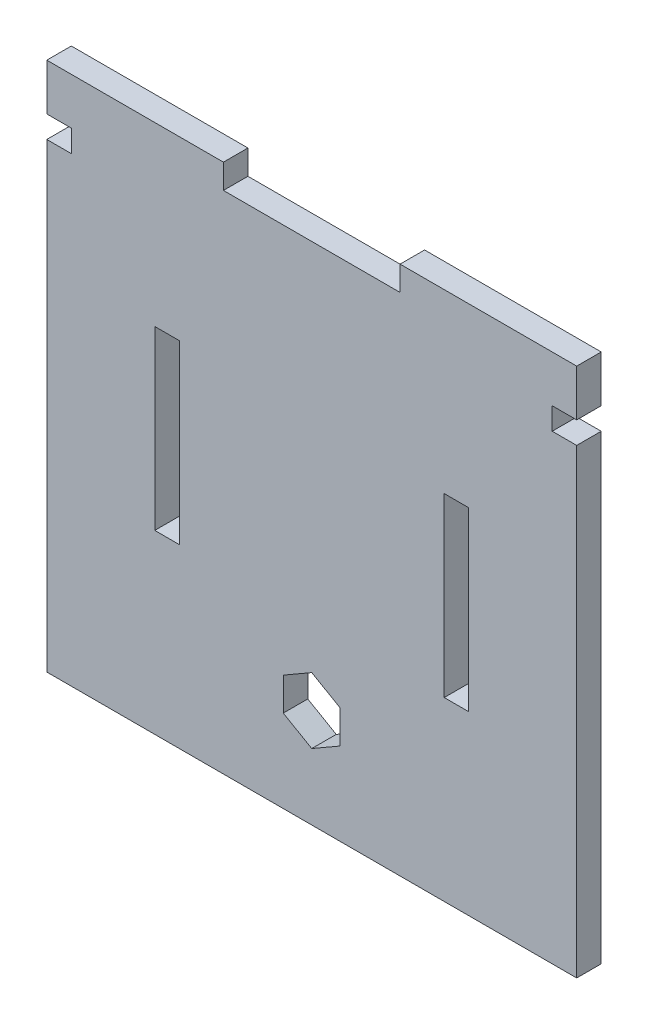
ISO-10303-21;
HEADER;
FILE_DESCRIPTION(('STEP AP214'),'2;1');
FILE_NAME('part.step','',(''),(''),'','','');
FILE_SCHEMA(('AUTOMOTIVE_DESIGN { 1 0 10303 214 1 1 1 1 }'));
ENDSEC;
DATA;
#1=APPLICATION_CONTEXT('core data for automotive mechanical design processes');
#2=APPLICATION_PROTOCOL_DEFINITION('international standard','automotive_design',2000,#1);
#3=PRODUCT_CONTEXT('',#1,'mechanical');
#4=PRODUCT('Part','Part','',(#3));
#5=PRODUCT_RELATED_PRODUCT_CATEGORY('part','',(#4));
#6=PRODUCT_DEFINITION_FORMATION('','',#4);
#7=PRODUCT_DEFINITION_CONTEXT('part definition',#1,'design');
#8=PRODUCT_DEFINITION('design','',#6,#7);
#9=PRODUCT_DEFINITION_SHAPE('','',#8);
#10=(LENGTH_UNIT() NAMED_UNIT(*) SI_UNIT(.MILLI.,.METRE.));
#11=(NAMED_UNIT(*) PLANE_ANGLE_UNIT() SI_UNIT($,.RADIAN.));
#12=(NAMED_UNIT(*) SI_UNIT($,.STERADIAN.) SOLID_ANGLE_UNIT());
#13=UNCERTAINTY_MEASURE_WITH_UNIT(LENGTH_MEASURE(1.E-05),#10,'distance_accuracy_value','');
#14=(GEOMETRIC_REPRESENTATION_CONTEXT(3) GLOBAL_UNCERTAINTY_ASSIGNED_CONTEXT((#13)) GLOBAL_UNIT_ASSIGNED_CONTEXT((#10,
#11,#12)) REPRESENTATION_CONTEXT('',''));
#15=CARTESIAN_POINT('',(0.,0.,0.));
#16=DIRECTION('',(0.,0.,1.));
#17=DIRECTION('',(1.,0.,0.));
#18=AXIS2_PLACEMENT_3D('',#15,#16,#17);
#19=CARTESIAN_POINT('',(0.,0.,0.));
#20=DIRECTION('',(0.,0.,-1.));
#21=DIRECTION('',(-1.,0.,0.));
#22=AXIS2_PLACEMENT_3D('',#19,#20,#21);
#23=PLANE('',#22);
#24=DIRECTION('',(0.,1.,0.));
#25=VECTOR('',#24,1.);
#26=CARTESIAN_POINT('',(0.,0.,0.));
#27=LINE('',#26,#25);
#28=CARTESIAN_POINT('',(0.,92.6676666666666,0.));
#29=VERTEX_POINT('',#28);
#30=CARTESIAN_POINT('',(0.,101.6,0.));
#31=VERTEX_POINT('',#30);
#32=EDGE_CURVE('E414',#29,#31,#27,.T.);
#33=ORIENTED_EDGE('',*,*,#32,.T.);
#34=DIRECTION('',(1.,0.,0.));
#35=VECTOR('',#34,1.);
#36=CARTESIAN_POINT('',(0.,101.6,0.));
#37=LINE('',#36,#35);
#38=CARTESIAN_POINT('',(33.8666666666667,101.6,0.));
#39=VERTEX_POINT('',#38);
#40=EDGE_CURVE('E431',#31,#39,#37,.T.);
#41=ORIENTED_EDGE('',*,*,#40,.T.);
#42=DIRECTION('',(0.,-1.,0.));
#43=VECTOR('',#42,1.);
#44=CARTESIAN_POINT('',(33.8666666666667,101.6,0.));
#45=LINE('',#44,#43);
#46=CARTESIAN_POINT('',(33.8666666666667,96.901,0.));
#47=VERTEX_POINT('',#46);
#48=EDGE_CURVE('E411',#39,#47,#45,.T.);
#49=ORIENTED_EDGE('',*,*,#48,.T.);
#50=DIRECTION('',(-1.,0.,0.));
#51=VECTOR('',#50,1.);
#52=CARTESIAN_POINT('',(0.,96.901,0.));
#53=LINE('',#52,#51);
#54=CARTESIAN_POINT('',(67.7333333333333,96.901,0.));
#55=VERTEX_POINT('',#54);
#56=EDGE_CURVE('E11',#55,#47,#53,.T.);
#57=ORIENTED_EDGE('',*,*,#56,.F.);
#58=DIRECTION('',(0.,-1.,0.));
#59=VECTOR('',#58,1.);
#60=CARTESIAN_POINT('',(67.7333333333333,101.6,0.));
#61=LINE('',#60,#59);
#62=CARTESIAN_POINT('',(67.7333333333333,101.6,0.));
#63=VERTEX_POINT('',#62);
#64=EDGE_CURVE('E398',#63,#55,#61,.T.);
#65=ORIENTED_EDGE('',*,*,#64,.F.);
#66=CARTESIAN_POINT('',(101.6,101.6,0.));
#67=VERTEX_POINT('',#66);
#68=EDGE_CURVE('E430',#63,#67,#37,.T.);
#69=ORIENTED_EDGE('',*,*,#68,.T.);
#70=DIRECTION('',(0.,1.,0.));
#71=VECTOR('',#70,1.);
#72=CARTESIAN_POINT('',(101.6,0.,0.));
#73=LINE('',#72,#71);
#74=CARTESIAN_POINT('',(101.6,92.6676666666667,0.));
#75=VERTEX_POINT('',#74);
#76=EDGE_CURVE('E434',#75,#67,#73,.T.);
#77=ORIENTED_EDGE('',*,*,#76,.F.);
#78=DIRECTION('',(-1.,0.,0.));
#79=VECTOR('',#78,1.);
#80=CARTESIAN_POINT('',(101.6,92.6676666666667,0.));
#81=LINE('',#80,#79);
#82=CARTESIAN_POINT('',(96.901,92.6676666666667,0.));
#83=VERTEX_POINT('',#82);
#84=EDGE_CURVE('E275',#75,#83,#81,.T.);
#85=ORIENTED_EDGE('',*,*,#84,.T.);
#86=DIRECTION('',(0.,1.,0.));
#87=VECTOR('',#86,1.);
#88=CARTESIAN_POINT('',(96.901,0.,0.));
#89=LINE('',#88,#87);
#90=CARTESIAN_POINT('',(96.901,88.4343333333334,0.));
#91=VERTEX_POINT('',#90);
#92=EDGE_CURVE('E278',#91,#83,#89,.T.);
#93=ORIENTED_EDGE('',*,*,#92,.F.);
#94=DIRECTION('',(-1.,0.,0.));
#95=VECTOR('',#94,1.);
#96=CARTESIAN_POINT('',(101.6,88.4343333333334,0.));
#97=LINE('',#96,#95);
#98=CARTESIAN_POINT('',(101.6,88.4343333333334,0.));
#99=VERTEX_POINT('',#98);
#100=EDGE_CURVE('E265',#99,#91,#97,.T.);
#101=ORIENTED_EDGE('',*,*,#100,.F.);
#102=CARTESIAN_POINT('',(101.6,0.,0.));
#103=VERTEX_POINT('',#102);
#104=EDGE_CURVE('E435',#103,#99,#73,.T.);
#105=ORIENTED_EDGE('',*,*,#104,.F.);
#106=DIRECTION('',(1.,0.,0.));
#107=VECTOR('',#106,1.);
#108=CARTESIAN_POINT('',(0.,0.,0.));
#109=LINE('',#108,#107);
#110=CARTESIAN_POINT('',(0.,0.,0.));
#111=VERTEX_POINT('',#110);
#112=EDGE_CURVE('E437',#111,#103,#109,.T.);
#113=ORIENTED_EDGE('',*,*,#112,.F.);
#114=CARTESIAN_POINT('',(0.,88.4343333333333,0.));
#115=VERTEX_POINT('',#114);
#116=EDGE_CURVE('E48',#111,#115,#27,.T.);
#117=ORIENTED_EDGE('',*,*,#116,.T.);
#118=DIRECTION('',(-1.,0.,0.));
#119=VECTOR('',#118,1.);
#120=CARTESIAN_POINT('',(4.69899999999999,88.4343333333333,0.));
#121=LINE('',#120,#119);
#122=CARTESIAN_POINT('',(4.69899999999999,88.4343333333333,0.));
#123=VERTEX_POINT('',#122);
#124=EDGE_CURVE('E254',#123,#115,#121,.T.);
#125=ORIENTED_EDGE('',*,*,#124,.F.);
#126=DIRECTION('',(0.,1.,0.));
#127=VECTOR('',#126,1.);
#128=CARTESIAN_POINT('',(4.69899999999999,0.,0.));
#129=LINE('',#128,#127);
#130=CARTESIAN_POINT('',(4.69899999999999,92.6676666666666,0.));
#131=VERTEX_POINT('',#130);
#132=EDGE_CURVE('E241',#123,#131,#129,.T.);
#133=ORIENTED_EDGE('',*,*,#132,.T.);
#134=DIRECTION('',(-1.,0.,0.));
#135=VECTOR('',#134,1.);
#136=CARTESIAN_POINT('',(4.69899999999999,92.6676666666666,0.));
#137=LINE('',#136,#135);
#138=EDGE_CURVE('E232',#131,#29,#137,.T.);
#139=ORIENTED_EDGE('',*,*,#138,.T.);
#140=EDGE_LOOP('',(#33,#41,#49,#57,#65,#69,#77,#85,#93,#101,#105,#113,#117,#125,#133,#139));
#141=FACE_BOUND('',#140,.T.);
#142=DIRECTION('',(-1.,0.,0.));
#143=VECTOR('',#142,1.);
#144=CARTESIAN_POINT('',(80.899,33.8666666666666,0.));
#145=LINE('',#144,#143);
#146=CARTESIAN_POINT('',(80.899,33.8666666666666,0.));
#147=VERTEX_POINT('',#146);
#148=CARTESIAN_POINT('',(76.2,33.8666666666666,0.));
#149=VERTEX_POINT('',#148);
#150=EDGE_CURVE('E350',#147,#149,#145,.T.);
#151=ORIENTED_EDGE('',*,*,#150,.F.);
#152=DIRECTION('',(0.,1.,0.));
#153=VECTOR('',#152,1.);
#154=CARTESIAN_POINT('',(80.899,33.8666666666666,0.));
#155=LINE('',#154,#153);
#156=CARTESIAN_POINT('',(80.899,67.7333333333333,0.));
#157=VERTEX_POINT('',#156);
#158=EDGE_CURVE('E332',#147,#157,#155,.T.);
#159=ORIENTED_EDGE('',*,*,#158,.T.);
#160=DIRECTION('',(-1.,0.,0.));
#161=VECTOR('',#160,1.);
#162=CARTESIAN_POINT('',(80.899,67.7333333333333,0.));
#163=LINE('',#162,#161);
#164=CARTESIAN_POINT('',(76.2,67.7333333333333,0.));
#165=VERTEX_POINT('',#164);
#166=EDGE_CURVE('E347',#157,#165,#163,.T.);
#167=ORIENTED_EDGE('',*,*,#166,.T.);
#168=DIRECTION('',(0.,1.,0.));
#169=VECTOR('',#168,1.);
#170=CARTESIAN_POINT('',(76.2,33.8666666666666,0.));
#171=LINE('',#170,#169);
#172=EDGE_CURVE('E342',#149,#165,#171,.T.);
#173=ORIENTED_EDGE('',*,*,#172,.F.);
#174=EDGE_LOOP('',(#151,#159,#167,#173));
#175=FACE_BOUND('',#174,.T.);
#176=DIRECTION('',(-1.,0.,0.));
#177=VECTOR('',#176,1.);
#178=CARTESIAN_POINT('',(25.4,33.8666666666666,0.));
#179=LINE('',#178,#177);
#180=CARTESIAN_POINT('',(25.4,33.8666666666666,0.));
#181=VERTEX_POINT('',#180);
#182=CARTESIAN_POINT('',(20.701,33.8666666666666,0.));
#183=VERTEX_POINT('',#182);
#184=EDGE_CURVE('E381',#181,#183,#179,.T.);
#185=ORIENTED_EDGE('',*,*,#184,.F.);
#186=DIRECTION('',(0.,1.,0.));
#187=VECTOR('',#186,1.);
#188=CARTESIAN_POINT('',(25.4,33.8666666666666,0.));
#189=LINE('',#188,#187);
#190=CARTESIAN_POINT('',(25.4,67.7333333333333,0.));
#191=VERTEX_POINT('',#190);
#192=EDGE_CURVE('E363',#181,#191,#189,.T.);
#193=ORIENTED_EDGE('',*,*,#192,.T.);
#194=DIRECTION('',(-1.,0.,0.));
#195=VECTOR('',#194,1.);
#196=CARTESIAN_POINT('',(25.4,67.7333333333333,0.));
#197=LINE('',#196,#195);
#198=CARTESIAN_POINT('',(20.701,67.7333333333333,0.));
#199=VERTEX_POINT('',#198);
#200=EDGE_CURVE('E378',#191,#199,#197,.T.);
#201=ORIENTED_EDGE('',*,*,#200,.T.);
#202=DIRECTION('',(0.,1.,0.));
#203=VECTOR('',#202,1.);
#204=CARTESIAN_POINT('',(20.701,33.8666666666666,0.));
#205=LINE('',#204,#203);
#206=EDGE_CURVE('E373',#183,#199,#205,.T.);
#207=ORIENTED_EDGE('',*,*,#206,.F.);
#208=EDGE_LOOP('',(#185,#193,#201,#207));
#209=FACE_BOUND('',#208,.T.);
#210=DIRECTION('',(-0.866025403784436,0.500000000000004,0.));
#211=VECTOR('',#210,1.);
#212=CARTESIAN_POINT('',(23.6602613140315,40.9807747162584,0.));
#213=LINE('',#212,#211);
#214=CARTESIAN_POINT('',(56.261,22.1587294601336,0.));
#215=VERTEX_POINT('',#214);
#216=CARTESIAN_POINT('',(50.8,25.3116392801782,0.));
#217=VERTEX_POINT('',#216);
#218=EDGE_CURVE('E323',#215,#217,#213,.T.);
#219=ORIENTED_EDGE('',*,*,#218,.T.);
#220=DIRECTION('',(-0.86602540378444,-0.499999999999998,0.));
#221=VECTOR('',#220,1.);
#222=CARTESIAN_POINT('',(1.73973868596873,-3.01331579599098,0.));
#223=LINE('',#222,#221);
#224=CARTESIAN_POINT('',(45.339,22.1587294601337,0.));
#225=VERTEX_POINT('',#224);
#226=EDGE_CURVE('E326',#217,#225,#223,.T.);
#227=ORIENTED_EDGE('',*,*,#226,.T.);
#228=DIRECTION('',(0.,-1.,0.));
#229=VECTOR('',#228,1.);
#230=CARTESIAN_POINT('',(45.339,0.,0.));
#231=LINE('',#230,#229);
#232=CARTESIAN_POINT('',(45.339,15.8529098200446,0.));
#233=VERTEX_POINT('',#232);
#234=EDGE_CURVE('E311',#225,#233,#231,.T.);
#235=ORIENTED_EDGE('',*,*,#234,.T.);
#236=DIRECTION('',(0.866025403784436,-0.500000000000004,0.));
#237=VECTOR('',#236,1.);
#238=CARTESIAN_POINT('',(18.1992613140314,31.5220452561248,0.));
#239=LINE('',#238,#237);
#240=CARTESIAN_POINT('',(50.8,12.7,0.));
#241=VERTEX_POINT('',#240);
#242=EDGE_CURVE('E314',#233,#241,#239,.T.);
#243=ORIENTED_EDGE('',*,*,#242,.T.);
#244=DIRECTION('',(0.86602540378444,0.499999999999998,0.));
#245=VECTOR('',#244,1.);
#246=CARTESIAN_POINT('',(7.20073868596872,-12.4720452561246,0.));
#247=LINE('',#246,#245);
#248=CARTESIAN_POINT('',(56.261,15.8529098200445,0.));
#249=VERTEX_POINT('',#248);
#250=EDGE_CURVE('E317',#241,#249,#247,.T.);
#251=ORIENTED_EDGE('',*,*,#250,.T.);
#252=DIRECTION('',(0.,1.,0.));
#253=VECTOR('',#252,1.);
#254=CARTESIAN_POINT('',(56.261,0.,0.));
#255=LINE('',#254,#253);
#256=EDGE_CURVE('E320',#249,#215,#255,.T.);
#257=ORIENTED_EDGE('',*,*,#256,.T.);
#258=EDGE_LOOP('',(#219,#227,#235,#243,#251,#257));
#259=FACE_BOUND('',#258,.T.);
#260=ADVANCED_FACE('F33',(#141,#175,#209,#259),#23,.T.);
#261=CARTESIAN_POINT('',(0.,0.,4.699));
#262=DIRECTION('',(0.,0.,-1.));
#263=DIRECTION('',(-1.,0.,0.));
#264=AXIS2_PLACEMENT_3D('',#261,#262,#263);
#265=PLANE('',#264);
#266=DIRECTION('',(0.,1.,0.));
#267=VECTOR('',#266,1.);
#268=CARTESIAN_POINT('',(25.4,0.,4.699));
#269=LINE('',#268,#267);
#270=CARTESIAN_POINT('',(25.4,33.8666666666666,4.69899999999999));
#271=VERTEX_POINT('',#270);
#272=CARTESIAN_POINT('',(25.4,67.7333333333333,4.69899999999999));
#273=VERTEX_POINT('',#272);
#274=EDGE_CURVE('E389',#271,#273,#269,.T.);
#275=ORIENTED_EDGE('',*,*,#274,.F.);
#276=DIRECTION('',(-1.,0.,0.));
#277=VECTOR('',#276,1.);
#278=CARTESIAN_POINT('',(25.4,33.8666666666666,4.69899999999999));
#279=LINE('',#278,#277);
#280=CARTESIAN_POINT('',(20.701,33.8666666666666,4.69899999999999));
#281=VERTEX_POINT('',#280);
#282=EDGE_CURVE('E383',#271,#281,#279,.T.);
#283=ORIENTED_EDGE('',*,*,#282,.T.);
#284=DIRECTION('',(0.,1.,0.));
#285=VECTOR('',#284,1.);
#286=CARTESIAN_POINT('',(20.701,0.,4.699));
#287=LINE('',#286,#285);
#288=CARTESIAN_POINT('',(20.701,67.7333333333333,4.699));
#289=VERTEX_POINT('',#288);
#290=EDGE_CURVE('E386',#281,#289,#287,.T.);
#291=ORIENTED_EDGE('',*,*,#290,.T.);
#292=DIRECTION('',(-1.,0.,0.));
#293=VECTOR('',#292,1.);
#294=CARTESIAN_POINT('',(25.4,67.7333333333333,4.69899999999999));
#295=LINE('',#294,#293);
#296=EDGE_CURVE('E370',#273,#289,#295,.T.);
#297=ORIENTED_EDGE('',*,*,#296,.F.);
#298=EDGE_LOOP('',(#275,#283,#291,#297));
#299=FACE_BOUND('',#298,.T.);
#300=DIRECTION('',(0.,1.,0.));
#301=VECTOR('',#300,1.);
#302=CARTESIAN_POINT('',(80.899,0.,4.699));
#303=LINE('',#302,#301);
#304=CARTESIAN_POINT('',(80.899,33.8666666666666,4.69899999999999));
#305=VERTEX_POINT('',#304);
#306=CARTESIAN_POINT('',(80.899,67.7333333333333,4.69899999999999));
#307=VERTEX_POINT('',#306);
#308=EDGE_CURVE('E358',#305,#307,#303,.T.);
#309=ORIENTED_EDGE('',*,*,#308,.F.);
#310=DIRECTION('',(-1.,0.,0.));
#311=VECTOR('',#310,1.);
#312=CARTESIAN_POINT('',(80.899,33.8666666666666,4.69899999999999));
#313=LINE('',#312,#311);
#314=CARTESIAN_POINT('',(76.2,33.8666666666666,4.69899999999999));
#315=VERTEX_POINT('',#314);
#316=EDGE_CURVE('E352',#305,#315,#313,.T.);
#317=ORIENTED_EDGE('',*,*,#316,.T.);
#318=DIRECTION('',(0.,1.,0.));
#319=VECTOR('',#318,1.);
#320=CARTESIAN_POINT('',(76.2,0.,4.699));
#321=LINE('',#320,#319);
#322=CARTESIAN_POINT('',(76.2,67.7333333333333,4.699));
#323=VERTEX_POINT('',#322);
#324=EDGE_CURVE('E355',#315,#323,#321,.T.);
#325=ORIENTED_EDGE('',*,*,#324,.T.);
#326=DIRECTION('',(-1.,0.,0.));
#327=VECTOR('',#326,1.);
#328=CARTESIAN_POINT('',(80.899,67.7333333333333,4.69899999999999));
#329=LINE('',#328,#327);
#330=EDGE_CURVE('E339',#307,#323,#329,.T.);
#331=ORIENTED_EDGE('',*,*,#330,.F.);
#332=EDGE_LOOP('',(#309,#317,#325,#331));
#333=FACE_BOUND('',#332,.T.);
#334=DIRECTION('',(0.86602540378444,0.499999999999998,0.));
#335=VECTOR('',#334,1.);
#336=CARTESIAN_POINT('',(50.8,25.3116392801782,4.69899999999999));
#337=LINE('',#336,#335);
#338=CARTESIAN_POINT('',(45.339,22.1587294601337,4.699));
#339=VERTEX_POINT('',#338);
#340=CARTESIAN_POINT('',(50.8,25.3116392801782,4.69899999999999));
#341=VERTEX_POINT('',#340);
#342=EDGE_CURVE('E280',#339,#341,#337,.T.);
#343=ORIENTED_EDGE('',*,*,#342,.T.);
#344=DIRECTION('',(0.866025403784436,-0.500000000000005,0.));
#345=VECTOR('',#344,1.);
#346=CARTESIAN_POINT('',(56.261,22.1587294601336,4.69899999999999));
#347=LINE('',#346,#345);
#348=CARTESIAN_POINT('',(56.261,22.1587294601336,4.69899999999999));
#349=VERTEX_POINT('',#348);
#350=EDGE_CURVE('E283',#341,#349,#347,.T.);
#351=ORIENTED_EDGE('',*,*,#350,.T.);
#352=DIRECTION('',(0.,-1.,0.));
#353=VECTOR('',#352,1.);
#354=CARTESIAN_POINT('',(56.261,15.8529098200445,4.69899999999999));
#355=LINE('',#354,#353);
#356=CARTESIAN_POINT('',(56.261,15.8529098200445,4.69899999999999));
#357=VERTEX_POINT('',#356);
#358=EDGE_CURVE('E286',#349,#357,#355,.T.);
#359=ORIENTED_EDGE('',*,*,#358,.T.);
#360=DIRECTION('',(-0.86602540378444,-0.499999999999998,0.));
#361=VECTOR('',#360,1.);
#362=CARTESIAN_POINT('',(50.8,12.7,4.69899999999999));
#363=LINE('',#362,#361);
#364=CARTESIAN_POINT('',(50.8,12.7,4.69899999999999));
#365=VERTEX_POINT('',#364);
#366=EDGE_CURVE('E289',#357,#365,#363,.T.);
#367=ORIENTED_EDGE('',*,*,#366,.T.);
#368=DIRECTION('',(-0.866025403784436,0.500000000000004,0.));
#369=VECTOR('',#368,1.);
#370=CARTESIAN_POINT('',(45.339,15.8529098200446,4.69899999999999));
#371=LINE('',#370,#369);
#372=CARTESIAN_POINT('',(45.339,15.8529098200446,4.69899999999999));
#373=VERTEX_POINT('',#372);
#374=EDGE_CURVE('E292',#365,#373,#371,.T.);
#375=ORIENTED_EDGE('',*,*,#374,.T.);
#376=DIRECTION('',(0.,1.,0.));
#377=VECTOR('',#376,1.);
#378=CARTESIAN_POINT('',(45.339,22.1587294601337,4.69899999999999));
#379=LINE('',#378,#377);
#380=EDGE_CURVE('E295',#373,#339,#379,.T.);
#381=ORIENTED_EDGE('',*,*,#380,.T.);
#382=EDGE_LOOP('',(#343,#351,#359,#367,#375,#381));
#383=FACE_BOUND('',#382,.T.);
#384=DIRECTION('',(-1.,0.,0.));
#385=VECTOR('',#384,1.);
#386=CARTESIAN_POINT('',(4.69899999999999,92.6676666666666,4.69899999999997));
#387=LINE('',#386,#385);
#388=CARTESIAN_POINT('',(4.69899999999999,92.6676666666666,4.69899999999997));
#389=VERTEX_POINT('',#388);
#390=CARTESIAN_POINT('',(0.,92.6676666666666,4.69899999999997));
#391=VERTEX_POINT('',#390);
#392=EDGE_CURVE('E242',#389,#391,#387,.T.);
#393=ORIENTED_EDGE('',*,*,#392,.F.);
#394=DIRECTION('',(0.,-1.,0.));
#395=VECTOR('',#394,1.);
#396=CARTESIAN_POINT('',(4.69899999999999,88.4343333333333,4.69899999999997));
#397=LINE('',#396,#395);
#398=CARTESIAN_POINT('',(4.69899999999999,88.4343333333333,4.69899999999997));
#399=VERTEX_POINT('',#398);
#400=EDGE_CURVE('E249',#389,#399,#397,.T.);
#401=ORIENTED_EDGE('',*,*,#400,.T.);
#402=DIRECTION('',(-1.,0.,0.));
#403=VECTOR('',#402,1.);
#404=CARTESIAN_POINT('',(4.69899999999999,88.4343333333333,4.69899999999997));
#405=LINE('',#404,#403);
#406=CARTESIAN_POINT('',(0.,88.4343333333333,4.69899999999997));
#407=VERTEX_POINT('',#406);
#408=EDGE_CURVE('E508',#399,#407,#405,.T.);
#409=ORIENTED_EDGE('',*,*,#408,.T.);
#410=DIRECTION('',(0.,1.,0.));
#411=VECTOR('',#410,1.);
#412=CARTESIAN_POINT('',(0.,0.,4.699));
#413=LINE('',#412,#411);
#414=CARTESIAN_POINT('',(0.,0.,4.699));
#415=VERTEX_POINT('',#414);
#416=EDGE_CURVE('E415',#415,#407,#413,.T.);
#417=ORIENTED_EDGE('',*,*,#416,.F.);
#418=DIRECTION('',(1.,0.,0.));
#419=VECTOR('',#418,1.);
#420=CARTESIAN_POINT('',(0.,0.,4.699));
#421=LINE('',#420,#419);
#422=CARTESIAN_POINT('',(101.6,0.,4.699));
#423=VERTEX_POINT('',#422);
#424=EDGE_CURVE('E426',#415,#423,#421,.T.);
#425=ORIENTED_EDGE('',*,*,#424,.T.);
#426=DIRECTION('',(0.,1.,0.));
#427=VECTOR('',#426,1.);
#428=CARTESIAN_POINT('',(101.6,0.,4.699));
#429=LINE('',#428,#427);
#430=CARTESIAN_POINT('',(101.6,88.4343333333334,4.699));
#431=VERTEX_POINT('',#430);
#432=EDGE_CURVE('E423',#423,#431,#429,.T.);
#433=ORIENTED_EDGE('',*,*,#432,.T.);
#434=DIRECTION('',(-1.,0.,0.));
#435=VECTOR('',#434,1.);
#436=CARTESIAN_POINT('',(101.6,88.4343333333334,4.69899999999997));
#437=LINE('',#436,#435);
#438=CARTESIAN_POINT('',(96.901,88.4343333333334,4.69899999999997));
#439=VERTEX_POINT('',#438);
#440=EDGE_CURVE('E56',#431,#439,#437,.T.);
#441=ORIENTED_EDGE('',*,*,#440,.T.);
#442=DIRECTION('',(0.,-1.,0.));
#443=VECTOR('',#442,1.);
#444=CARTESIAN_POINT('',(96.901,88.4343333333334,4.69899999999997));
#445=LINE('',#444,#443);
#446=CARTESIAN_POINT('',(96.901,92.6676666666667,4.69899999999997));
#447=VERTEX_POINT('',#446);
#448=EDGE_CURVE('E257',#447,#439,#445,.T.);
#449=ORIENTED_EDGE('',*,*,#448,.F.);
#450=DIRECTION('',(-1.,0.,0.));
#451=VECTOR('',#450,1.);
#452=CARTESIAN_POINT('',(101.6,92.6676666666667,4.69899999999997));
#453=LINE('',#452,#451);
#454=CARTESIAN_POINT('',(101.6,92.6676666666667,4.69899999999997));
#455=VERTEX_POINT('',#454);
#456=EDGE_CURVE('E272',#455,#447,#453,.T.);
#457=ORIENTED_EDGE('',*,*,#456,.F.);
#458=CARTESIAN_POINT('',(101.6,101.6,4.699));
#459=VERTEX_POINT('',#458);
#460=EDGE_CURVE('E422',#455,#459,#429,.T.);
#461=ORIENTED_EDGE('',*,*,#460,.T.);
#462=DIRECTION('',(1.,0.,0.));
#463=VECTOR('',#462,1.);
#464=CARTESIAN_POINT('',(0.,101.6,4.699));
#465=LINE('',#464,#463);
#466=CARTESIAN_POINT('',(67.7333333333333,101.6,4.699));
#467=VERTEX_POINT('',#466);
#468=EDGE_CURVE('E418',#467,#459,#465,.T.);
#469=ORIENTED_EDGE('',*,*,#468,.F.);
#470=DIRECTION('',(0.,-1.,0.));
#471=VECTOR('',#470,1.);
#472=CARTESIAN_POINT('',(67.7333333333333,101.6,4.699));
#473=LINE('',#472,#471);
#474=CARTESIAN_POINT('',(67.7333333333333,96.901,4.699));
#475=VERTEX_POINT('',#474);
#476=EDGE_CURVE('E405',#467,#475,#473,.T.);
#477=ORIENTED_EDGE('',*,*,#476,.T.);
#478=DIRECTION('',(1.,0.,0.));
#479=VECTOR('',#478,1.);
#480=CARTESIAN_POINT('',(33.8666666666667,96.901,4.699));
#481=LINE('',#480,#479);
#482=CARTESIAN_POINT('',(33.8666666666667,96.901,4.699));
#483=VERTEX_POINT('',#482);
#484=EDGE_CURVE('E400',#483,#475,#481,.T.);
#485=ORIENTED_EDGE('',*,*,#484,.F.);
#486=DIRECTION('',(0.,-1.,0.));
#487=VECTOR('',#486,1.);
#488=CARTESIAN_POINT('',(33.8666666666667,101.6,4.699));
#489=LINE('',#488,#487);
#490=CARTESIAN_POINT('',(33.8666666666667,101.6,4.699));
#491=VERTEX_POINT('',#490);
#492=EDGE_CURVE('E408',#491,#483,#489,.T.);
#493=ORIENTED_EDGE('',*,*,#492,.F.);
#494=CARTESIAN_POINT('',(0.,101.6,4.699));
#495=VERTEX_POINT('',#494);
#496=EDGE_CURVE('E420',#495,#491,#465,.T.);
#497=ORIENTED_EDGE('',*,*,#496,.F.);
#498=EDGE_CURVE('E419',#391,#495,#413,.T.);
#499=ORIENTED_EDGE('',*,*,#498,.F.);
#500=EDGE_LOOP('',(#393,#401,#409,#417,#425,#433,#441,#449,#457,#461,#469,#477,#485,#493,#497,#499));
#501=FACE_BOUND('',#500,.T.);
#502=ADVANCED_FACE('F511',(#299,#333,#383,#501),#265,.F.);
#503=CARTESIAN_POINT('',(0.,0.,4.699));
#504=DIRECTION('',(-1.,0.,0.));
#505=DIRECTION('',(0.,0.,1.));
#506=AXIS2_PLACEMENT_3D('',#503,#504,#505);
#507=PLANE('',#506);
#508=ORIENTED_EDGE('',*,*,#32,.F.);
#509=DIRECTION('',(0.,0.,1.));
#510=VECTOR('',#509,1.);
#511=CARTESIAN_POINT('',(0.,92.6676666666666,0.));
#512=LINE('',#511,#510);
#513=EDGE_CURVE('E238',#29,#391,#512,.T.);
#514=ORIENTED_EDGE('',*,*,#513,.T.);
#515=ORIENTED_EDGE('',*,*,#498,.T.);
#516=DIRECTION('',(0.,0.,-1.));
#517=VECTOR('',#516,1.);
#518=CARTESIAN_POINT('',(0.,101.6,4.699));
#519=LINE('',#518,#517);
#520=EDGE_CURVE('E428',#495,#31,#519,.T.);
#521=ORIENTED_EDGE('',*,*,#520,.T.);
#522=EDGE_LOOP('',(#508,#514,#515,#521));
#523=FACE_BOUND('',#522,.T.);
#524=ADVANCED_FACE('F35',(#523),#507,.T.);
#525=ORIENTED_EDGE('',*,*,#416,.T.);
#526=DIRECTION('',(0.,0.,-1.));
#527=VECTOR('',#526,1.);
#528=CARTESIAN_POINT('',(0.,88.4343333333333,0.));
#529=LINE('',#528,#527);
#530=EDGE_CURVE('E251',#407,#115,#529,.T.);
#531=ORIENTED_EDGE('',*,*,#530,.T.);
#532=ORIENTED_EDGE('',*,*,#116,.F.);
#533=DIRECTION('',(0.,0.,-1.));
#534=VECTOR('',#533,1.);
#535=CARTESIAN_POINT('',(0.,0.,4.699));
#536=LINE('',#535,#534);
#537=EDGE_CURVE('E41',#415,#111,#536,.T.);
#538=ORIENTED_EDGE('',*,*,#537,.F.);
#539=EDGE_LOOP('',(#525,#531,#532,#538));
#540=FACE_BOUND('',#539,.T.);
#541=ADVANCED_FACE('F499',(#540),#507,.T.);
#542=CARTESIAN_POINT('',(101.6,0.,4.699));
#543=DIRECTION('',(-1.,0.,0.));
#544=DIRECTION('',(0.,0.,1.));
#545=AXIS2_PLACEMENT_3D('',#542,#543,#544);
#546=PLANE('',#545);
#547=DIRECTION('',(0.,0.,1.));
#548=VECTOR('',#547,1.);
#549=CARTESIAN_POINT('',(101.6,92.6676666666667,0.));
#550=LINE('',#549,#548);
#551=EDGE_CURVE('E261',#75,#455,#550,.T.);
#552=ORIENTED_EDGE('',*,*,#551,.F.);
#553=ORIENTED_EDGE('',*,*,#76,.T.);
#554=DIRECTION('',(0.,0.,-1.));
#555=VECTOR('',#554,1.);
#556=CARTESIAN_POINT('',(101.6,101.6,4.699));
#557=LINE('',#556,#555);
#558=EDGE_CURVE('E443',#459,#67,#557,.T.);
#559=ORIENTED_EDGE('',*,*,#558,.F.);
#560=ORIENTED_EDGE('',*,*,#460,.F.);
#561=EDGE_LOOP('',(#552,#553,#559,#560));
#562=FACE_BOUND('',#561,.T.);
#563=ADVANCED_FACE('F478',(#562),#546,.F.);
#564=DIRECTION('',(0.,0.,-1.));
#565=VECTOR('',#564,1.);
#566=CARTESIAN_POINT('',(101.6,88.4343333333334,0.));
#567=LINE('',#566,#565);
#568=EDGE_CURVE('E263',#431,#99,#567,.T.);
#569=ORIENTED_EDGE('',*,*,#568,.F.);
#570=ORIENTED_EDGE('',*,*,#432,.F.);
#571=DIRECTION('',(0.,0.,-1.));
#572=VECTOR('',#571,1.);
#573=CARTESIAN_POINT('',(101.6,0.,4.699));
#574=LINE('',#573,#572);
#575=EDGE_CURVE('E440',#423,#103,#574,.T.);
#576=ORIENTED_EDGE('',*,*,#575,.T.);
#577=ORIENTED_EDGE('',*,*,#104,.T.);
#578=EDGE_LOOP('',(#569,#570,#576,#577));
#579=FACE_BOUND('',#578,.T.);
#580=ADVANCED_FACE('F491',(#579),#546,.F.);
#581=CARTESIAN_POINT('',(0.,101.6,4.699));
#582=DIRECTION('',(0.,1.,0.));
#583=DIRECTION('',(0.,0.,1.));
#584=AXIS2_PLACEMENT_3D('',#581,#582,#583);
#585=PLANE('',#584);
#586=ORIENTED_EDGE('',*,*,#496,.T.);
#587=DIRECTION('',(0.,0.,1.));
#588=VECTOR('',#587,1.);
#589=CARTESIAN_POINT('',(33.8666666666667,101.6,0.));
#590=LINE('',#589,#588);
#591=EDGE_CURVE('E392',#39,#491,#590,.T.);
#592=ORIENTED_EDGE('',*,*,#591,.F.);
#593=ORIENTED_EDGE('',*,*,#40,.F.);
#594=ORIENTED_EDGE('',*,*,#520,.F.);
#595=EDGE_LOOP('',(#586,#592,#593,#594));
#596=FACE_BOUND('',#595,.T.);
#597=ADVANCED_FACE('F453',(#596),#585,.T.);
#598=ORIENTED_EDGE('',*,*,#68,.F.);
#599=DIRECTION('',(0.,0.,-1.));
#600=VECTOR('',#599,1.);
#601=CARTESIAN_POINT('',(67.7333333333333,101.6,0.));
#602=LINE('',#601,#600);
#603=EDGE_CURVE('E395',#467,#63,#602,.T.);
#604=ORIENTED_EDGE('',*,*,#603,.F.);
#605=ORIENTED_EDGE('',*,*,#468,.T.);
#606=ORIENTED_EDGE('',*,*,#558,.T.);
#607=EDGE_LOOP('',(#598,#604,#605,#606));
#608=FACE_BOUND('',#607,.T.);
#609=ADVANCED_FACE('F471',(#608),#585,.T.);
#610=CARTESIAN_POINT('',(0.,0.,4.699));
#611=DIRECTION('',(0.,1.,0.));
#612=DIRECTION('',(0.,0.,1.));
#613=AXIS2_PLACEMENT_3D('',#610,#611,#612);
#614=PLANE('',#613);
#615=ORIENTED_EDGE('',*,*,#112,.T.);
#616=ORIENTED_EDGE('',*,*,#575,.F.);
#617=ORIENTED_EDGE('',*,*,#424,.F.);
#618=ORIENTED_EDGE('',*,*,#537,.T.);
#619=EDGE_LOOP('',(#615,#616,#617,#618));
#620=FACE_BOUND('',#619,.T.);
#621=ADVANCED_FACE('F496',(#620),#614,.F.);
#622=CARTESIAN_POINT('',(0.,96.901,0.));
#623=DIRECTION('',(0.,-1.,0.));
#624=DIRECTION('',(-1.,0.,0.));
#625=AXIS2_PLACEMENT_3D('',#622,#623,#624);
#626=PLANE('',#625);
#627=ORIENTED_EDGE('',*,*,#56,.T.);
#628=DIRECTION('',(0.,0.,1.));
#629=VECTOR('',#628,1.);
#630=CARTESIAN_POINT('',(33.8666666666667,96.901,0.));
#631=LINE('',#630,#629);
#632=EDGE_CURVE('E391',#47,#483,#631,.T.);
#633=ORIENTED_EDGE('',*,*,#632,.T.);
#634=ORIENTED_EDGE('',*,*,#484,.T.);
#635=DIRECTION('',(0.,0.,-1.));
#636=VECTOR('',#635,1.);
#637=CARTESIAN_POINT('',(67.7333333333333,96.901,0.));
#638=LINE('',#637,#636);
#639=EDGE_CURVE('E396',#475,#55,#638,.T.);
#640=ORIENTED_EDGE('',*,*,#639,.T.);
#641=EDGE_LOOP('',(#627,#633,#634,#640));
#642=FACE_BOUND('',#641,.T.);
#643=ADVANCED_FACE('F462',(#642),#626,.F.);
#644=CARTESIAN_POINT('',(33.8666666666667,101.6,0.));
#645=DIRECTION('',(1.,0.,0.));
#646=DIRECTION('',(0.,-1.,0.));
#647=AXIS2_PLACEMENT_3D('',#644,#645,#646);
#648=PLANE('',#647);
#649=ORIENTED_EDGE('',*,*,#632,.F.);
#650=ORIENTED_EDGE('',*,*,#48,.F.);
#651=ORIENTED_EDGE('',*,*,#591,.T.);
#652=ORIENTED_EDGE('',*,*,#492,.T.);
#653=EDGE_LOOP('',(#649,#650,#651,#652));
#654=FACE_BOUND('',#653,.T.);
#655=ADVANCED_FACE('F458',(#654),#648,.T.);
#656=CARTESIAN_POINT('',(67.7333333333333,101.6,0.));
#657=DIRECTION('',(-1.,0.,0.));
#658=DIRECTION('',(0.,1.,0.));
#659=AXIS2_PLACEMENT_3D('',#656,#657,#658);
#660=PLANE('',#659);
#661=ORIENTED_EDGE('',*,*,#639,.F.);
#662=ORIENTED_EDGE('',*,*,#476,.F.);
#663=ORIENTED_EDGE('',*,*,#603,.T.);
#664=ORIENTED_EDGE('',*,*,#64,.T.);
#665=EDGE_LOOP('',(#661,#662,#663,#664));
#666=FACE_BOUND('',#665,.T.);
#667=ADVANCED_FACE('F465',(#666),#660,.T.);
#668=CARTESIAN_POINT('',(25.4,0.,4.69899999999999));
#669=DIRECTION('',(-1.,0.,0.));
#670=DIRECTION('',(0.,-1.,0.));
#671=AXIS2_PLACEMENT_3D('',#668,#669,#670);
#672=PLANE('',#671);
#673=ORIENTED_EDGE('',*,*,#274,.T.);
#674=DIRECTION('',(0.,0.,1.));
#675=VECTOR('',#674,1.);
#676=CARTESIAN_POINT('',(25.4,67.7333333333333,4.69899999999999));
#677=LINE('',#676,#675);
#678=EDGE_CURVE('E367',#191,#273,#677,.T.);
#679=ORIENTED_EDGE('',*,*,#678,.F.);
#680=ORIENTED_EDGE('',*,*,#192,.F.);
#681=DIRECTION('',(0.,0.,-1.));
#682=VECTOR('',#681,1.);
#683=CARTESIAN_POINT('',(25.4,33.8666666666666,4.69899999999999));
#684=LINE('',#683,#682);
#685=EDGE_CURVE('E361',#271,#181,#684,.T.);
#686=ORIENTED_EDGE('',*,*,#685,.F.);
#687=EDGE_LOOP('',(#673,#679,#680,#686));
#688=FACE_BOUND('',#687,.T.);
#689=ADVANCED_FACE('F690',(#688),#672,.T.);
#690=CARTESIAN_POINT('',(20.701,0.,4.69899999999999));
#691=DIRECTION('',(-1.,0.,0.));
#692=DIRECTION('',(0.,-1.,0.));
#693=AXIS2_PLACEMENT_3D('',#690,#691,#692);
#694=PLANE('',#693);
#695=DIRECTION('',(0.,0.,-1.));
#696=VECTOR('',#695,1.);
#697=CARTESIAN_POINT('',(20.701,33.8666666666666,4.69899999999999));
#698=LINE('',#697,#696);
#699=EDGE_CURVE('E360',#281,#183,#698,.T.);
#700=ORIENTED_EDGE('',*,*,#699,.T.);
#701=ORIENTED_EDGE('',*,*,#206,.T.);
#702=DIRECTION('',(0.,0.,1.));
#703=VECTOR('',#702,1.);
#704=CARTESIAN_POINT('',(20.701,67.7333333333333,4.69899999999999));
#705=LINE('',#704,#703);
#706=EDGE_CURVE('E364',#199,#289,#705,.T.);
#707=ORIENTED_EDGE('',*,*,#706,.T.);
#708=ORIENTED_EDGE('',*,*,#290,.F.);
#709=EDGE_LOOP('',(#700,#701,#707,#708));
#710=FACE_BOUND('',#709,.T.);
#711=ADVANCED_FACE('F681',(#710),#694,.F.);
#712=CARTESIAN_POINT('',(25.4,33.8666666666666,4.69899999999999));
#713=DIRECTION('',(0.,1.,0.));
#714=DIRECTION('',(0.,0.,1.));
#715=AXIS2_PLACEMENT_3D('',#712,#713,#714);
#716=PLANE('',#715);
#717=ORIENTED_EDGE('',*,*,#699,.F.);
#718=ORIENTED_EDGE('',*,*,#282,.F.);
#719=ORIENTED_EDGE('',*,*,#685,.T.);
#720=ORIENTED_EDGE('',*,*,#184,.T.);
#721=EDGE_LOOP('',(#717,#718,#719,#720));
#722=FACE_BOUND('',#721,.T.);
#723=ADVANCED_FACE('F672',(#722),#716,.T.);
#724=CARTESIAN_POINT('',(25.4,67.7333333333333,4.69899999999999));
#725=DIRECTION('',(0.,-1.,0.));
#726=DIRECTION('',(0.,0.,-1.));
#727=AXIS2_PLACEMENT_3D('',#724,#725,#726);
#728=PLANE('',#727);
#729=ORIENTED_EDGE('',*,*,#706,.F.);
#730=ORIENTED_EDGE('',*,*,#200,.F.);
#731=ORIENTED_EDGE('',*,*,#678,.T.);
#732=ORIENTED_EDGE('',*,*,#296,.T.);
#733=EDGE_LOOP('',(#729,#730,#731,#732));
#734=FACE_BOUND('',#733,.T.);
#735=ADVANCED_FACE('F663',(#734),#728,.T.);
#736=CARTESIAN_POINT('',(80.899,0.,4.69899999999999));
#737=DIRECTION('',(-1.,0.,0.));
#738=DIRECTION('',(0.,-1.,0.));
#739=AXIS2_PLACEMENT_3D('',#736,#737,#738);
#740=PLANE('',#739);
#741=ORIENTED_EDGE('',*,*,#308,.T.);
#742=DIRECTION('',(0.,0.,1.));
#743=VECTOR('',#742,1.);
#744=CARTESIAN_POINT('',(80.899,67.7333333333333,4.69899999999999));
#745=LINE('',#744,#743);
#746=EDGE_CURVE('E336',#157,#307,#745,.T.);
#747=ORIENTED_EDGE('',*,*,#746,.F.);
#748=ORIENTED_EDGE('',*,*,#158,.F.);
#749=DIRECTION('',(0.,0.,-1.));
#750=VECTOR('',#749,1.);
#751=CARTESIAN_POINT('',(80.899,33.8666666666666,4.69899999999999));
#752=LINE('',#751,#750);
#753=EDGE_CURVE('E330',#305,#147,#752,.T.);
#754=ORIENTED_EDGE('',*,*,#753,.F.);
#755=EDGE_LOOP('',(#741,#747,#748,#754));
#756=FACE_BOUND('',#755,.T.);
#757=ADVANCED_FACE('F654',(#756),#740,.T.);
#758=CARTESIAN_POINT('',(76.2,0.,4.69899999999999));
#759=DIRECTION('',(-1.,0.,0.));
#760=DIRECTION('',(0.,-1.,0.));
#761=AXIS2_PLACEMENT_3D('',#758,#759,#760);
#762=PLANE('',#761);
#763=DIRECTION('',(0.,0.,-1.));
#764=VECTOR('',#763,1.);
#765=CARTESIAN_POINT('',(76.2,33.8666666666666,4.69899999999999));
#766=LINE('',#765,#764);
#767=EDGE_CURVE('E329',#315,#149,#766,.T.);
#768=ORIENTED_EDGE('',*,*,#767,.T.);
#769=ORIENTED_EDGE('',*,*,#172,.T.);
#770=DIRECTION('',(0.,0.,1.));
#771=VECTOR('',#770,1.);
#772=CARTESIAN_POINT('',(76.2,67.7333333333333,4.69899999999999));
#773=LINE('',#772,#771);
#774=EDGE_CURVE('E333',#165,#323,#773,.T.);
#775=ORIENTED_EDGE('',*,*,#774,.T.);
#776=ORIENTED_EDGE('',*,*,#324,.F.);
#777=EDGE_LOOP('',(#768,#769,#775,#776));
#778=FACE_BOUND('',#777,.T.);
#779=ADVANCED_FACE('F645',(#778),#762,.F.);
#780=CARTESIAN_POINT('',(80.899,33.8666666666666,4.69899999999999));
#781=DIRECTION('',(0.,1.,0.));
#782=DIRECTION('',(0.,0.,1.));
#783=AXIS2_PLACEMENT_3D('',#780,#781,#782);
#784=PLANE('',#783);
#785=ORIENTED_EDGE('',*,*,#767,.F.);
#786=ORIENTED_EDGE('',*,*,#316,.F.);
#787=ORIENTED_EDGE('',*,*,#753,.T.);
#788=ORIENTED_EDGE('',*,*,#150,.T.);
#789=EDGE_LOOP('',(#785,#786,#787,#788));
#790=FACE_BOUND('',#789,.T.);
#791=ADVANCED_FACE('F636',(#790),#784,.T.);
#792=CARTESIAN_POINT('',(80.899,67.7333333333333,4.69899999999999));
#793=DIRECTION('',(0.,-1.,0.));
#794=DIRECTION('',(0.,0.,-1.));
#795=AXIS2_PLACEMENT_3D('',#792,#793,#794);
#796=PLANE('',#795);
#797=ORIENTED_EDGE('',*,*,#774,.F.);
#798=ORIENTED_EDGE('',*,*,#166,.F.);
#799=ORIENTED_EDGE('',*,*,#746,.T.);
#800=ORIENTED_EDGE('',*,*,#330,.T.);
#801=EDGE_LOOP('',(#797,#798,#799,#800));
#802=FACE_BOUND('',#801,.T.);
#803=ADVANCED_FACE('F626',(#802),#796,.T.);
#804=CARTESIAN_POINT('',(50.8,25.3116392801782,-8.001));
#805=DIRECTION('',(0.499999999999998,-0.86602540378444,0.));
#806=DIRECTION('',(-0.86602540378444,-0.499999999999998,0.));
#807=AXIS2_PLACEMENT_3D('',#804,#805,#806);
#808=PLANE('',#807);
#809=DIRECTION('',(0.,0.,1.));
#810=VECTOR('',#809,1.);
#811=CARTESIAN_POINT('',(50.8,25.3116392801782,-8.001));
#812=LINE('',#811,#810);
#813=EDGE_CURVE('E309',#217,#341,#812,.T.);
#814=ORIENTED_EDGE('',*,*,#813,.T.);
#815=ORIENTED_EDGE('',*,*,#342,.F.);
#816=DIRECTION('',(0.,0.,1.));
#817=VECTOR('',#816,1.);
#818=CARTESIAN_POINT('',(45.339,22.1587294601337,-8.001));
#819=LINE('',#818,#817);
#820=EDGE_CURVE('E298',#225,#339,#819,.T.);
#821=ORIENTED_EDGE('',*,*,#820,.F.);
#822=ORIENTED_EDGE('',*,*,#226,.F.);
#823=EDGE_LOOP('',(#814,#815,#821,#822));
#824=FACE_BOUND('',#823,.T.);
#825=ADVANCED_FACE('F616',(#824),#808,.T.);
#826=CARTESIAN_POINT('',(56.261,22.1587294601336,-8.001));
#827=DIRECTION('',(-0.500000000000004,-0.866025403784436,0.));
#828=DIRECTION('',(-0.866025403784436,0.500000000000004,0.));
#829=AXIS2_PLACEMENT_3D('',#826,#827,#828);
#830=PLANE('',#829);
#831=DIRECTION('',(0.,0.,1.));
#832=VECTOR('',#831,1.);
#833=CARTESIAN_POINT('',(56.261,22.1587294601336,-8.001));
#834=LINE('',#833,#832);
#835=EDGE_CURVE('E307',#215,#349,#834,.T.);
#836=ORIENTED_EDGE('',*,*,#835,.T.);
#837=ORIENTED_EDGE('',*,*,#350,.F.);
#838=ORIENTED_EDGE('',*,*,#813,.F.);
#839=ORIENTED_EDGE('',*,*,#218,.F.);
#840=EDGE_LOOP('',(#836,#837,#838,#839));
#841=FACE_BOUND('',#840,.T.);
#842=ADVANCED_FACE('F606',(#841),#830,.T.);
#843=CARTESIAN_POINT('',(56.261,15.8529098200445,-8.001));
#844=DIRECTION('',(-1.,0.,0.));
#845=DIRECTION('',(0.,0.,-1.));
#846=AXIS2_PLACEMENT_3D('',#843,#844,#845);
#847=PLANE('',#846);
#848=DIRECTION('',(0.,0.,1.));
#849=VECTOR('',#848,1.);
#850=CARTESIAN_POINT('',(56.261,15.8529098200445,-8.001));
#851=LINE('',#850,#849);
#852=EDGE_CURVE('E305',#249,#357,#851,.T.);
#853=ORIENTED_EDGE('',*,*,#852,.T.);
#854=ORIENTED_EDGE('',*,*,#358,.F.);
#855=ORIENTED_EDGE('',*,*,#835,.F.);
#856=ORIENTED_EDGE('',*,*,#256,.F.);
#857=EDGE_LOOP('',(#853,#854,#855,#856));
#858=FACE_BOUND('',#857,.T.);
#859=ADVANCED_FACE('F596',(#858),#847,.T.);
#860=CARTESIAN_POINT('',(50.8,12.7,-8.001));
#861=DIRECTION('',(-0.499999999999998,0.86602540378444,0.));
#862=DIRECTION('',(0.86602540378444,0.499999999999998,0.));
#863=AXIS2_PLACEMENT_3D('',#860,#861,#862);
#864=PLANE('',#863);
#865=DIRECTION('',(0.,0.,1.));
#866=VECTOR('',#865,1.);
#867=CARTESIAN_POINT('',(50.8,12.7,-8.001));
#868=LINE('',#867,#866);
#869=EDGE_CURVE('E303',#241,#365,#868,.T.);
#870=ORIENTED_EDGE('',*,*,#869,.T.);
#871=ORIENTED_EDGE('',*,*,#366,.F.);
#872=ORIENTED_EDGE('',*,*,#852,.F.);
#873=ORIENTED_EDGE('',*,*,#250,.F.);
#874=EDGE_LOOP('',(#870,#871,#872,#873));
#875=FACE_BOUND('',#874,.T.);
#876=ADVANCED_FACE('F586',(#875),#864,.T.);
#877=CARTESIAN_POINT('',(45.339,15.8529098200446,-8.001));
#878=DIRECTION('',(0.500000000000004,0.866025403784436,0.));
#879=DIRECTION('',(0.866025403784436,-0.500000000000004,0.));
#880=AXIS2_PLACEMENT_3D('',#877,#878,#879);
#881=PLANE('',#880);
#882=DIRECTION('',(0.,0.,1.));
#883=VECTOR('',#882,1.);
#884=CARTESIAN_POINT('',(45.339,15.8529098200446,-8.001));
#885=LINE('',#884,#883);
#886=EDGE_CURVE('E301',#233,#373,#885,.T.);
#887=ORIENTED_EDGE('',*,*,#886,.T.);
#888=ORIENTED_EDGE('',*,*,#374,.F.);
#889=ORIENTED_EDGE('',*,*,#869,.F.);
#890=ORIENTED_EDGE('',*,*,#242,.F.);
#891=EDGE_LOOP('',(#887,#888,#889,#890));
#892=FACE_BOUND('',#891,.T.);
#893=ADVANCED_FACE('F576',(#892),#881,.T.);
#894=CARTESIAN_POINT('',(45.339,22.1587294601337,-8.001));
#895=DIRECTION('',(1.,0.,0.));
#896=DIRECTION('',(0.,0.,1.));
#897=AXIS2_PLACEMENT_3D('',#894,#895,#896);
#898=PLANE('',#897);
#899=ORIENTED_EDGE('',*,*,#820,.T.);
#900=ORIENTED_EDGE('',*,*,#380,.F.);
#901=ORIENTED_EDGE('',*,*,#886,.F.);
#902=ORIENTED_EDGE('',*,*,#234,.F.);
#903=EDGE_LOOP('',(#899,#900,#901,#902));
#904=FACE_BOUND('',#903,.T.);
#905=ADVANCED_FACE('F571',(#904),#898,.T.);
#906=CARTESIAN_POINT('',(101.6,92.6676666666667,0.));
#907=DIRECTION('',(0.,-1.,0.));
#908=DIRECTION('',(0.,0.,-1.));
#909=AXIS2_PLACEMENT_3D('',#906,#907,#908);
#910=PLANE('',#909);
#911=DIRECTION('',(0.,0.,1.));
#912=VECTOR('',#911,1.);
#913=CARTESIAN_POINT('',(96.901,92.6676666666667,0.));
#914=LINE('',#913,#912);
#915=EDGE_CURVE('E255',#83,#447,#914,.T.);
#916=ORIENTED_EDGE('',*,*,#915,.F.);
#917=ORIENTED_EDGE('',*,*,#84,.F.);
#918=ORIENTED_EDGE('',*,*,#551,.T.);
#919=ORIENTED_EDGE('',*,*,#456,.T.);
#920=EDGE_LOOP('',(#916,#917,#918,#919));
#921=FACE_BOUND('',#920,.T.);
#922=ADVANCED_FACE('F483',(#921),#910,.T.);
#923=CARTESIAN_POINT('',(101.6,88.4343333333334,0.));
#924=DIRECTION('',(0.,1.,0.));
#925=DIRECTION('',(0.,0.,1.));
#926=AXIS2_PLACEMENT_3D('',#923,#924,#925);
#927=PLANE('',#926);
#928=DIRECTION('',(0.,0.,-1.));
#929=VECTOR('',#928,1.);
#930=CARTESIAN_POINT('',(96.901,88.4343333333334,0.));
#931=LINE('',#930,#929);
#932=EDGE_CURVE('E264',#439,#91,#931,.T.);
#933=ORIENTED_EDGE('',*,*,#932,.F.);
#934=ORIENTED_EDGE('',*,*,#440,.F.);
#935=ORIENTED_EDGE('',*,*,#568,.T.);
#936=ORIENTED_EDGE('',*,*,#100,.T.);
#937=EDGE_LOOP('',(#933,#934,#935,#936));
#938=FACE_BOUND('',#937,.T.);
#939=ADVANCED_FACE('F488',(#938),#927,.T.);
#940=CARTESIAN_POINT('',(96.901,84.201,-31.75));
#941=DIRECTION('',(-1.,0.,0.));
#942=DIRECTION('',(0.,-1.,0.));
#943=AXIS2_PLACEMENT_3D('',#940,#941,#942);
#944=PLANE('',#943);
#945=ORIENTED_EDGE('',*,*,#92,.T.);
#946=ORIENTED_EDGE('',*,*,#915,.T.);
#947=ORIENTED_EDGE('',*,*,#448,.T.);
#948=ORIENTED_EDGE('',*,*,#932,.T.);
#949=EDGE_LOOP('',(#945,#946,#947,#948));
#950=FACE_BOUND('',#949,.T.);
#951=ADVANCED_FACE('F487',(#950),#944,.F.);
#952=CARTESIAN_POINT('',(4.69899999999999,92.6676666666666,0.));
#953=DIRECTION('',(0.,-1.,0.));
#954=DIRECTION('',(0.,0.,-1.));
#955=AXIS2_PLACEMENT_3D('',#952,#953,#954);
#956=PLANE('',#955);
#957=ORIENTED_EDGE('',*,*,#513,.F.);
#958=ORIENTED_EDGE('',*,*,#138,.F.);
#959=DIRECTION('',(0.,0.,1.));
#960=VECTOR('',#959,1.);
#961=CARTESIAN_POINT('',(4.69899999999999,92.6676666666666,0.));
#962=LINE('',#961,#960);
#963=EDGE_CURVE('E235',#131,#389,#962,.T.);
#964=ORIENTED_EDGE('',*,*,#963,.T.);
#965=ORIENTED_EDGE('',*,*,#392,.T.);
#966=EDGE_LOOP('',(#957,#958,#964,#965));
#967=FACE_BOUND('',#966,.T.);
#968=ADVANCED_FACE('F234',(#967),#956,.T.);
#969=CARTESIAN_POINT('',(4.69899999999999,88.4343333333333,0.));
#970=DIRECTION('',(0.,1.,0.));
#971=DIRECTION('',(0.,0.,1.));
#972=AXIS2_PLACEMENT_3D('',#969,#970,#971);
#973=PLANE('',#972);
#974=ORIENTED_EDGE('',*,*,#530,.F.);
#975=ORIENTED_EDGE('',*,*,#408,.F.);
#976=DIRECTION('',(0.,0.,-1.));
#977=VECTOR('',#976,1.);
#978=CARTESIAN_POINT('',(4.69899999999999,88.4343333333333,0.));
#979=LINE('',#978,#977);
#980=EDGE_CURVE('E509',#399,#123,#979,.T.);
#981=ORIENTED_EDGE('',*,*,#980,.T.);
#982=ORIENTED_EDGE('',*,*,#124,.T.);
#983=EDGE_LOOP('',(#974,#975,#981,#982));
#984=FACE_BOUND('',#983,.T.);
#985=ADVANCED_FACE('F512',(#984),#973,.T.);
#986=CARTESIAN_POINT('',(4.69899999999999,84.201,-31.75));
#987=DIRECTION('',(-1.,0.,0.));
#988=DIRECTION('',(0.,-1.,0.));
#989=AXIS2_PLACEMENT_3D('',#986,#987,#988);
#990=PLANE('',#989);
#991=ORIENTED_EDGE('',*,*,#980,.F.);
#992=ORIENTED_EDGE('',*,*,#400,.F.);
#993=ORIENTED_EDGE('',*,*,#963,.F.);
#994=ORIENTED_EDGE('',*,*,#132,.F.);
#995=EDGE_LOOP('',(#991,#992,#993,#994));
#996=FACE_BOUND('',#995,.T.);
#997=ADVANCED_FACE('F246',(#996),#990,.T.);
#998=CLOSED_SHELL('',(#260,#502,#524,#541,#563,#580,#597,#609,#621,#643,#655,#667,#689,#711,
#723,#735,#757,#779,#791,#803,#825,#842,#859,#876,#893,#905,#922,#939,#951,#968,#985,#997));
#999=MANIFOLD_SOLID_BREP('B2',#998);
#1000=ADVANCED_BREP_SHAPE_REPRESENTATION('',(#18,#999),#14);
#1001=SHAPE_DEFINITION_REPRESENTATION(#9,#1000);
ENDSEC;
END-ISO-10303-21;
